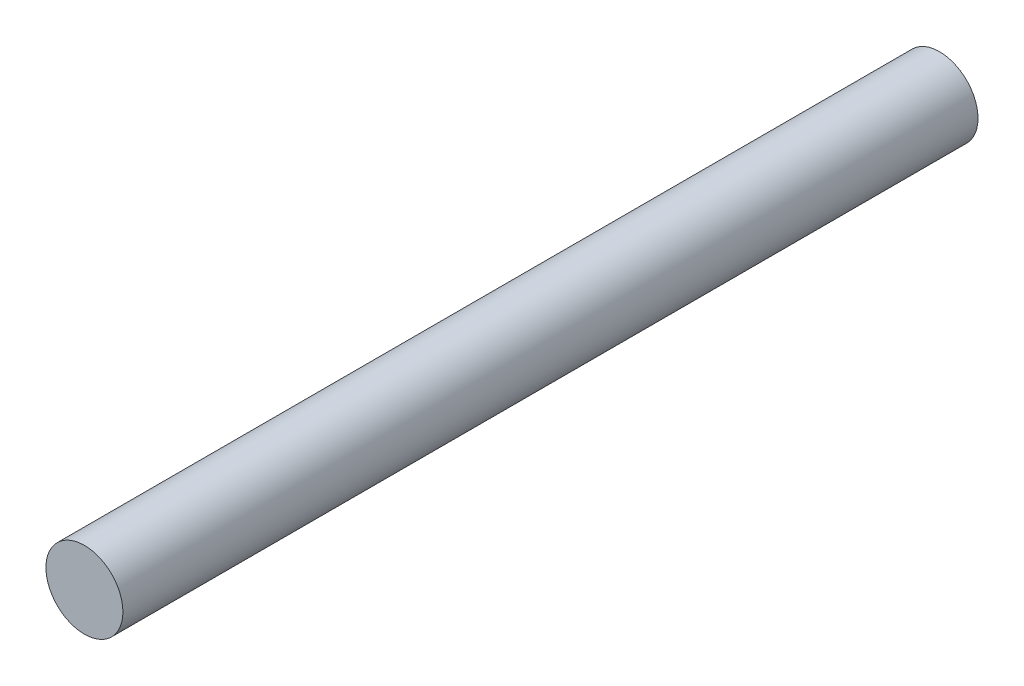
ISO-10303-21;
HEADER;
FILE_DESCRIPTION(('STEP AP214'),'2;1');
FILE_NAME('part.step','',(''),(''),'','','');
FILE_SCHEMA(('AUTOMOTIVE_DESIGN { 1 0 10303 214 1 1 1 1 }'));
ENDSEC;
DATA;
#1=APPLICATION_CONTEXT('core data for automotive mechanical design processes');
#2=APPLICATION_PROTOCOL_DEFINITION('international standard','automotive_design',2000,#1);
#3=PRODUCT_CONTEXT('',#1,'mechanical');
#4=PRODUCT('Part','Part','',(#3));
#5=PRODUCT_RELATED_PRODUCT_CATEGORY('part','',(#4));
#6=PRODUCT_DEFINITION_FORMATION('','',#4);
#7=PRODUCT_DEFINITION_CONTEXT('part definition',#1,'design');
#8=PRODUCT_DEFINITION('design','',#6,#7);
#9=PRODUCT_DEFINITION_SHAPE('','',#8);
#10=(LENGTH_UNIT() NAMED_UNIT(*) SI_UNIT(.MILLI.,.METRE.));
#11=(NAMED_UNIT(*) PLANE_ANGLE_UNIT() SI_UNIT($,.RADIAN.));
#12=(NAMED_UNIT(*) SI_UNIT($,.STERADIAN.) SOLID_ANGLE_UNIT());
#13=UNCERTAINTY_MEASURE_WITH_UNIT(LENGTH_MEASURE(1.E-05),#10,'distance_accuracy_value','');
#14=(GEOMETRIC_REPRESENTATION_CONTEXT(3) GLOBAL_UNCERTAINTY_ASSIGNED_CONTEXT((#13)) GLOBAL_UNIT_ASSIGNED_CONTEXT((#10,
#11,#12)) REPRESENTATION_CONTEXT('',''));
#15=CARTESIAN_POINT('',(0.,0.,0.));
#16=DIRECTION('',(0.,0.,1.));
#17=DIRECTION('',(1.,0.,0.));
#18=AXIS2_PLACEMENT_3D('',#15,#16,#17);
#19=CARTESIAN_POINT('',(-336.55,927.1,99.6555438789302));
#20=DIRECTION('',(0.,0.,1.));
#21=DIRECTION('',(1.,0.,0.));
#22=AXIS2_PLACEMENT_3D('',#19,#20,#21);
#23=CYLINDRICAL_SURFACE('',#22,3.17499999999997);
#24=CARTESIAN_POINT('',(-336.55,927.1,108.635799999999));
#25=DIRECTION('',(0.,0.,1.));
#26=DIRECTION('',(1.,0.,0.));
#27=AXIS2_PLACEMENT_3D('',#24,#25,#26);
#28=CIRCLE('',#27,3.17499999999997);
#29=CARTESIAN_POINT('',(-333.375,927.1,108.635799999999));
#30=VERTEX_POINT('',#29);
#31=EDGE_CURVE('E10',#30,#30,#28,.F.);
#32=ORIENTED_EDGE('',*,*,#31,.F.);
#33=EDGE_LOOP('',(#32));
#34=FACE_BOUND('',#33,.T.);
#35=CARTESIAN_POINT('',(-336.55,927.1,179.16652));
#36=DIRECTION('',(0.,0.,1.));
#37=DIRECTION('',(1.,0.,0.));
#38=AXIS2_PLACEMENT_3D('',#35,#36,#37);
#39=CIRCLE('',#38,3.17499999999997);
#40=CARTESIAN_POINT('',(-333.375,927.1,179.16652));
#41=VERTEX_POINT('',#40);
#42=EDGE_CURVE('E37',#41,#41,#39,.T.);
#43=ORIENTED_EDGE('',*,*,#42,.F.);
#44=EDGE_LOOP('',(#43));
#45=FACE_BOUND('',#44,.T.);
#46=ADVANCED_FACE('F31',(#34,#45),#23,.T.);
#47=CARTESIAN_POINT('',(-336.55,927.1,179.16652));
#48=DIRECTION('',(0.,0.,1.));
#49=DIRECTION('',(1.,0.,0.));
#50=AXIS2_PLACEMENT_3D('',#47,#48,#49);
#51=PLANE('',#50);
#52=ORIENTED_EDGE('',*,*,#42,.T.);
#53=EDGE_LOOP('',(#52));
#54=FACE_BOUND('',#53,.T.);
#55=ADVANCED_FACE('F43',(#54),#51,.T.);
#56=CARTESIAN_POINT('',(0.,0.,108.635799999999));
#57=DIRECTION('',(0.,0.,1.));
#58=DIRECTION('',(1.,0.,0.));
#59=AXIS2_PLACEMENT_3D('',#56,#57,#58);
#60=PLANE('',#59);
#61=ORIENTED_EDGE('',*,*,#31,.T.);
#62=EDGE_LOOP('',(#61));
#63=FACE_BOUND('',#62,.T.);
#64=ADVANCED_FACE('F50',(#63),#60,.F.);
#65=CLOSED_SHELL('',(#46,#55,#64));
#66=MANIFOLD_SOLID_BREP('B2',#65);
#67=ADVANCED_BREP_SHAPE_REPRESENTATION('',(#18,#66),#14);
#68=SHAPE_DEFINITION_REPRESENTATION(#9,#67);
ENDSEC;
END-ISO-10303-21;
